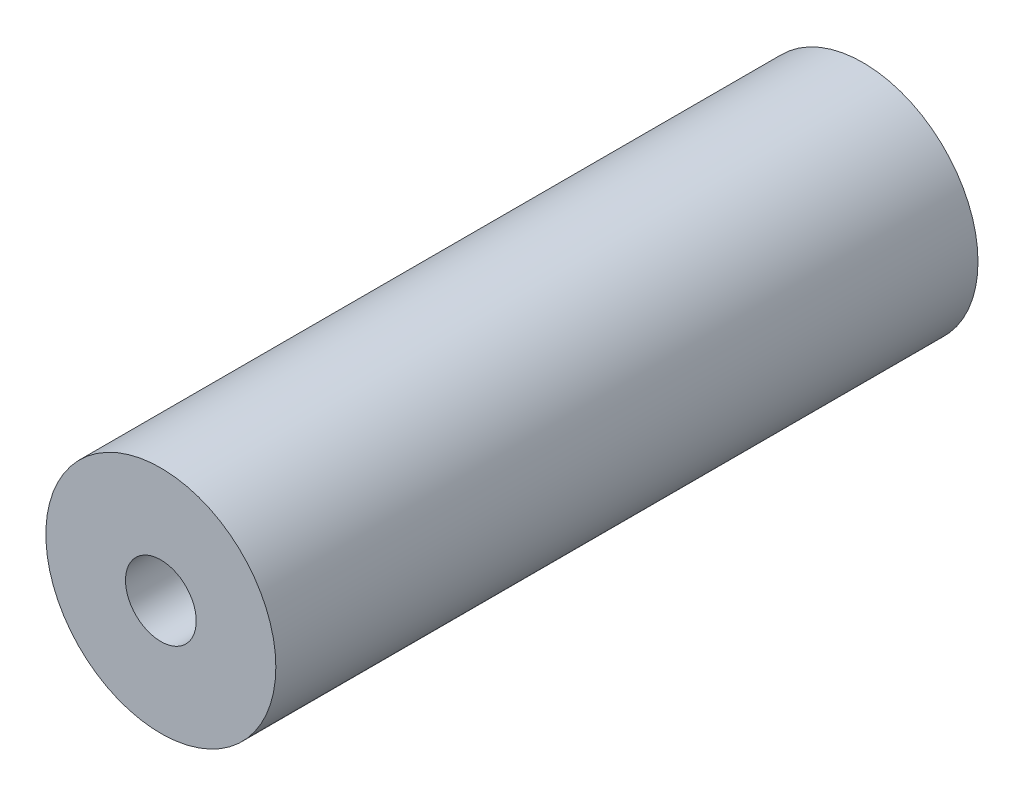
ISO-10303-21;
HEADER;
FILE_DESCRIPTION(('STEP AP214'),'2;1');
FILE_NAME('part.step','',(''),(''),'','','');
FILE_SCHEMA(('AUTOMOTIVE_DESIGN { 1 0 10303 214 1 1 1 1 }'));
ENDSEC;
DATA;
#1=APPLICATION_CONTEXT('core data for automotive mechanical design processes');
#2=APPLICATION_PROTOCOL_DEFINITION('international standard','automotive_design',2000,#1);
#3=PRODUCT_CONTEXT('',#1,'mechanical');
#4=PRODUCT('Part','Part','',(#3));
#5=PRODUCT_RELATED_PRODUCT_CATEGORY('part','',(#4));
#6=PRODUCT_DEFINITION_FORMATION('','',#4);
#7=PRODUCT_DEFINITION_CONTEXT('part definition',#1,'design');
#8=PRODUCT_DEFINITION('design','',#6,#7);
#9=PRODUCT_DEFINITION_SHAPE('','',#8);
#10=(LENGTH_UNIT() NAMED_UNIT(*) SI_UNIT(.MILLI.,.METRE.));
#11=(NAMED_UNIT(*) PLANE_ANGLE_UNIT() SI_UNIT($,.RADIAN.));
#12=(NAMED_UNIT(*) SI_UNIT($,.STERADIAN.) SOLID_ANGLE_UNIT());
#13=UNCERTAINTY_MEASURE_WITH_UNIT(LENGTH_MEASURE(1.E-05),#10,'distance_accuracy_value','');
#14=(GEOMETRIC_REPRESENTATION_CONTEXT(3) GLOBAL_UNCERTAINTY_ASSIGNED_CONTEXT((#13)) GLOBAL_UNIT_ASSIGNED_CONTEXT((#10,
#11,#12)) REPRESENTATION_CONTEXT('',''));
#15=CARTESIAN_POINT('',(0.,0.,0.));
#16=DIRECTION('',(0.,0.,1.));
#17=DIRECTION('',(1.,0.,0.));
#18=AXIS2_PLACEMENT_3D('',#15,#16,#17);
#19=CARTESIAN_POINT('',(0.,0.,-39.6875));
#20=DIRECTION('',(0.,0.,1.));
#21=DIRECTION('',(1.,0.,0.));
#22=AXIS2_PLACEMENT_3D('',#19,#20,#21);
#23=CYLINDRICAL_SURFACE('',#22,6.5);
#24=CARTESIAN_POINT('',(0.,0.,-39.6875));
#25=DIRECTION('',(0.,0.,1.));
#26=DIRECTION('',(1.,0.,0.));
#27=AXIS2_PLACEMENT_3D('',#24,#25,#26);
#28=CIRCLE('',#27,6.5);
#29=CARTESIAN_POINT('',(6.5,0.,-39.6875));
#30=VERTEX_POINT('',#29);
#31=EDGE_CURVE('E10',#30,#30,#28,.T.);
#32=ORIENTED_EDGE('',*,*,#31,.T.);
#33=EDGE_LOOP('',(#32));
#34=FACE_BOUND('',#33,.T.);
#35=CARTESIAN_POINT('',(0.,0.,0.));
#36=DIRECTION('',(0.,0.,1.));
#37=DIRECTION('',(1.,0.,0.));
#38=AXIS2_PLACEMENT_3D('',#35,#36,#37);
#39=CIRCLE('',#38,6.5);
#40=CARTESIAN_POINT('',(6.5,0.,0.));
#41=VERTEX_POINT('',#40);
#42=EDGE_CURVE('E44',#41,#41,#39,.T.);
#43=ORIENTED_EDGE('',*,*,#42,.F.);
#44=EDGE_LOOP('',(#43));
#45=FACE_BOUND('',#44,.T.);
#46=ADVANCED_FACE('F41',(#34,#45),#23,.T.);
#47=CARTESIAN_POINT('',(0.,0.,-39.6875));
#48=DIRECTION('',(0.,0.,1.));
#49=DIRECTION('',(1.,0.,0.));
#50=AXIS2_PLACEMENT_3D('',#47,#48,#49);
#51=PLANE('',#50);
#52=CARTESIAN_POINT('',(0.,0.,-39.6875));
#53=DIRECTION('',(0.,0.,1.));
#54=DIRECTION('',(1.,0.,0.));
#55=AXIS2_PLACEMENT_3D('',#52,#53,#54);
#56=CIRCLE('',#55,2.);
#57=CARTESIAN_POINT('',(2.,0.,-39.6875));
#58=VERTEX_POINT('',#57);
#59=EDGE_CURVE('E53',#58,#58,#56,.T.);
#60=ORIENTED_EDGE('',*,*,#59,.T.);
#61=EDGE_LOOP('',(#60));
#62=FACE_BOUND('',#61,.T.);
#63=ORIENTED_EDGE('',*,*,#31,.F.);
#64=EDGE_LOOP('',(#63));
#65=FACE_BOUND('',#64,.T.);
#66=ADVANCED_FACE('F63',(#62,#65),#51,.F.);
#67=CARTESIAN_POINT('',(0.,0.,0.));
#68=DIRECTION('',(0.,0.,1.));
#69=DIRECTION('',(1.,0.,0.));
#70=AXIS2_PLACEMENT_3D('',#67,#68,#69);
#71=PLANE('',#70);
#72=CARTESIAN_POINT('',(0.,0.,0.));
#73=DIRECTION('',(0.,0.,1.));
#74=DIRECTION('',(1.,0.,0.));
#75=AXIS2_PLACEMENT_3D('',#72,#73,#74);
#76=CIRCLE('',#75,2.);
#77=CARTESIAN_POINT('',(2.,0.,0.));
#78=VERTEX_POINT('',#77);
#79=EDGE_CURVE('E55',#78,#78,#76,.T.);
#80=ORIENTED_EDGE('',*,*,#79,.F.);
#81=EDGE_LOOP('',(#80));
#82=FACE_BOUND('',#81,.T.);
#83=ORIENTED_EDGE('',*,*,#42,.T.);
#84=EDGE_LOOP('',(#83));
#85=FACE_BOUND('',#84,.T.);
#86=ADVANCED_FACE('F69',(#82,#85),#71,.T.);
#87=CARTESIAN_POINT('',(0.,0.,-39.6875));
#88=DIRECTION('',(0.,0.,1.));
#89=DIRECTION('',(1.,0.,0.));
#90=AXIS2_PLACEMENT_3D('',#87,#88,#89);
#91=CYLINDRICAL_SURFACE('',#90,2.);
#92=ORIENTED_EDGE('',*,*,#59,.F.);
#93=EDGE_LOOP('',(#92));
#94=FACE_BOUND('',#93,.T.);
#95=ORIENTED_EDGE('',*,*,#79,.T.);
#96=EDGE_LOOP('',(#95));
#97=FACE_BOUND('',#96,.T.);
#98=ADVANCED_FACE('F66',(#94,#97),#91,.F.);
#99=CLOSED_SHELL('',(#46,#66,#86,#98));
#100=MANIFOLD_SOLID_BREP('B2',#99);
#101=ADVANCED_BREP_SHAPE_REPRESENTATION('',(#18,#100),#14);
#102=SHAPE_DEFINITION_REPRESENTATION(#9,#101);
ENDSEC;
END-ISO-10303-21;
